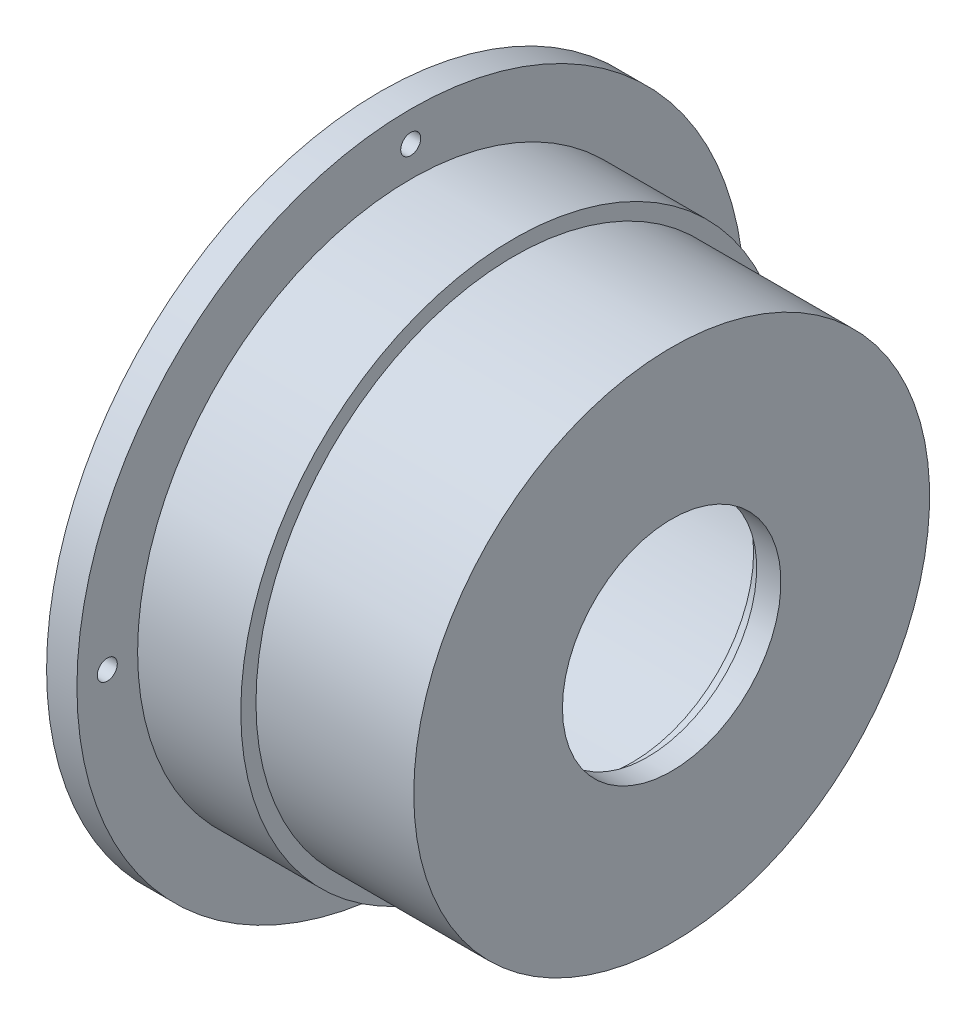
ISO-10303-21;
HEADER;
FILE_DESCRIPTION(('STEP AP214'),'2;1');
FILE_NAME('part.step','',(''),(''),'','','');
FILE_SCHEMA(('AUTOMOTIVE_DESIGN { 1 0 10303 214 1 1 1 1 }'));
ENDSEC;
DATA;
#1=APPLICATION_CONTEXT('core data for automotive mechanical design processes');
#2=APPLICATION_PROTOCOL_DEFINITION('international standard','automotive_design',2000,#1);
#3=PRODUCT_CONTEXT('',#1,'mechanical');
#4=PRODUCT('Part','Part','',(#3));
#5=PRODUCT_RELATED_PRODUCT_CATEGORY('part','',(#4));
#6=PRODUCT_DEFINITION_FORMATION('','',#4);
#7=PRODUCT_DEFINITION_CONTEXT('part definition',#1,'design');
#8=PRODUCT_DEFINITION('design','',#6,#7);
#9=PRODUCT_DEFINITION_SHAPE('','',#8);
#10=(LENGTH_UNIT() NAMED_UNIT(*) SI_UNIT(.MILLI.,.METRE.));
#11=(NAMED_UNIT(*) PLANE_ANGLE_UNIT() SI_UNIT($,.RADIAN.));
#12=(NAMED_UNIT(*) SI_UNIT($,.STERADIAN.) SOLID_ANGLE_UNIT());
#13=UNCERTAINTY_MEASURE_WITH_UNIT(LENGTH_MEASURE(1.E-05),#10,'distance_accuracy_value','');
#14=(GEOMETRIC_REPRESENTATION_CONTEXT(3) GLOBAL_UNCERTAINTY_ASSIGNED_CONTEXT((#13)) GLOBAL_UNIT_ASSIGNED_CONTEXT((#10,
#11,#12)) REPRESENTATION_CONTEXT('',''));
#15=CARTESIAN_POINT('',(0.,0.,0.));
#16=DIRECTION('',(0.,0.,1.));
#17=DIRECTION('',(1.,0.,0.));
#18=AXIS2_PLACEMENT_3D('',#15,#16,#17);
#19=CARTESIAN_POINT('',(0.,55.,0.));
#20=DIRECTION('',(1.,0.,0.));
#21=DIRECTION('',(0.,0.,-1.));
#22=AXIS2_PLACEMENT_3D('',#19,#20,#21);
#23=PLANE('',#22);
#24=CARTESIAN_POINT('',(0.,50.,0.));
#25=DIRECTION('',(-1.,0.,0.));
#26=DIRECTION('',(0.,0.,1.));
#27=AXIS2_PLACEMENT_3D('',#24,#25,#26);
#28=CIRCLE('',#27,1.64999999999999);
#29=CARTESIAN_POINT('',(0.,50.,1.64999999999999));
#30=VERTEX_POINT('',#29);
#31=EDGE_CURVE('E77',#30,#30,#28,.T.);
#32=ORIENTED_EDGE('',*,*,#31,.F.);
#33=EDGE_LOOP('',(#32));
#34=FACE_BOUND('',#33,.T.);
#35=CARTESIAN_POINT('',(0.,0.,50.));
#36=DIRECTION('',(-1.,0.,0.));
#37=DIRECTION('',(0.,0.,1.));
#38=AXIS2_PLACEMENT_3D('',#35,#36,#37);
#39=CIRCLE('',#38,1.64999999999999);
#40=CARTESIAN_POINT('',(0.,0.,51.65));
#41=VERTEX_POINT('',#40);
#42=EDGE_CURVE('E64',#41,#41,#39,.T.);
#43=ORIENTED_EDGE('',*,*,#42,.F.);
#44=EDGE_LOOP('',(#43));
#45=FACE_BOUND('',#44,.T.);
#46=CARTESIAN_POINT('',(0.,-50.,0.));
#47=DIRECTION('',(-1.,0.,0.));
#48=DIRECTION('',(0.,0.,1.));
#49=AXIS2_PLACEMENT_3D('',#46,#47,#48);
#50=CIRCLE('',#49,1.64999999999999);
#51=CARTESIAN_POINT('',(0.,-50.,1.64999999999999));
#52=VERTEX_POINT('',#51);
#53=EDGE_CURVE('E60',#52,#52,#50,.T.);
#54=ORIENTED_EDGE('',*,*,#53,.F.);
#55=EDGE_LOOP('',(#54));
#56=FACE_BOUND('',#55,.T.);
#57=CARTESIAN_POINT('',(0.,0.,0.));
#58=DIRECTION('',(-1.,0.,0.));
#59=DIRECTION('',(0.,0.,1.));
#60=AXIS2_PLACEMENT_3D('',#57,#58,#59);
#61=CIRCLE('',#60,37.6);
#62=CARTESIAN_POINT('',(0.,0.,37.6));
#63=VERTEX_POINT('',#62);
#64=EDGE_CURVE('E10',#63,#63,#61,.T.);
#65=ORIENTED_EDGE('',*,*,#64,.F.);
#66=EDGE_LOOP('',(#65));
#67=FACE_BOUND('',#66,.T.);
#68=CARTESIAN_POINT('',(0.,0.,0.));
#69=DIRECTION('',(-1.,0.,0.));
#70=DIRECTION('',(0.,0.,1.));
#71=AXIS2_PLACEMENT_3D('',#68,#69,#70);
#72=CIRCLE('',#71,55.);
#73=CARTESIAN_POINT('',(0.,0.,55.));
#74=VERTEX_POINT('',#73);
#75=EDGE_CURVE('E87',#74,#74,#72,.T.);
#76=ORIENTED_EDGE('',*,*,#75,.T.);
#77=EDGE_LOOP('',(#76));
#78=FACE_BOUND('',#77,.T.);
#79=CARTESIAN_POINT('',(0.,0.,-50.));
#80=DIRECTION('',(-1.,0.,0.));
#81=DIRECTION('',(0.,0.,1.));
#82=AXIS2_PLACEMENT_3D('',#79,#80,#81);
#83=CIRCLE('',#82,1.64999999999999);
#84=CARTESIAN_POINT('',(0.,0.,-48.35));
#85=VERTEX_POINT('',#84);
#86=EDGE_CURVE('E59',#85,#85,#83,.T.);
#87=ORIENTED_EDGE('',*,*,#86,.F.);
#88=EDGE_LOOP('',(#87));
#89=FACE_BOUND('',#88,.T.);
#90=ADVANCED_FACE('F37',(#34,#45,#56,#67,#78,#89),#23,.F.);
#91=CARTESIAN_POINT('',(-64.1033524540557,0.,0.));
#92=DIRECTION('',(-1.,0.,0.));
#93=DIRECTION('',(0.,0.,1.));
#94=AXIS2_PLACEMENT_3D('',#91,#92,#93);
#95=CYLINDRICAL_SURFACE('',#94,37.6);
#96=CARTESIAN_POINT('',(41.5,0.,0.));
#97=DIRECTION('',(-1.,0.,0.));
#98=DIRECTION('',(0.,0.,1.));
#99=AXIS2_PLACEMENT_3D('',#96,#97,#98);
#100=CIRCLE('',#99,37.6);
#101=CARTESIAN_POINT('',(41.5,0.,37.6));
#102=VERTEX_POINT('',#101);
#103=EDGE_CURVE('E46',#102,#102,#100,.T.);
#104=ORIENTED_EDGE('',*,*,#103,.F.);
#105=EDGE_LOOP('',(#104));
#106=FACE_BOUND('',#105,.T.);
#107=ORIENTED_EDGE('',*,*,#64,.T.);
#108=EDGE_LOOP('',(#107));
#109=FACE_BOUND('',#108,.T.);
#110=ADVANCED_FACE('F39',(#106,#109),#95,.F.);
#111=CARTESIAN_POINT('',(41.5,37.6,0.));
#112=DIRECTION('',(1.,0.,0.));
#113=DIRECTION('',(0.,0.,-1.));
#114=AXIS2_PLACEMENT_3D('',#111,#112,#113);
#115=PLANE('',#114);
#116=CARTESIAN_POINT('',(41.5000000000001,0.,0.));
#117=DIRECTION('',(-1.,0.,0.));
#118=DIRECTION('',(0.,0.,1.));
#119=AXIS2_PLACEMENT_3D('',#116,#117,#118);
#120=CIRCLE('',#119,20.);
#121=CARTESIAN_POINT('',(41.5000000000001,0.,20.));
#122=VERTEX_POINT('',#121);
#123=EDGE_CURVE('E52',#122,#122,#120,.T.);
#124=ORIENTED_EDGE('',*,*,#123,.F.);
#125=EDGE_LOOP('',(#124));
#126=FACE_BOUND('',#125,.T.);
#127=ORIENTED_EDGE('',*,*,#103,.T.);
#128=EDGE_LOOP('',(#127));
#129=FACE_BOUND('',#128,.T.);
#130=ADVANCED_FACE('F128',(#126,#129),#115,.F.);
#131=CARTESIAN_POINT('',(-64.1033524540557,0.,0.));
#132=DIRECTION('',(-1.,0.,0.));
#133=DIRECTION('',(0.,0.,1.));
#134=AXIS2_PLACEMENT_3D('',#131,#132,#133);
#135=CYLINDRICAL_SURFACE('',#134,20.);
#136=CARTESIAN_POINT('',(44.,0.,0.));
#137=DIRECTION('',(-1.,0.,0.));
#138=DIRECTION('',(0.,0.,1.));
#139=AXIS2_PLACEMENT_3D('',#136,#137,#138);
#140=CIRCLE('',#139,20.);
#141=CARTESIAN_POINT('',(44.,0.,20.));
#142=VERTEX_POINT('',#141);
#143=EDGE_CURVE('E119',#142,#142,#140,.T.);
#144=ORIENTED_EDGE('',*,*,#143,.F.);
#145=EDGE_LOOP('',(#144));
#146=FACE_BOUND('',#145,.T.);
#147=ORIENTED_EDGE('',*,*,#123,.T.);
#148=EDGE_LOOP('',(#147));
#149=FACE_BOUND('',#148,.T.);
#150=ADVANCED_FACE('F126',(#146,#149),#135,.F.);
#151=CARTESIAN_POINT('',(44.0000000000001,20.,0.));
#152=DIRECTION('',(1.,0.,0.));
#153=DIRECTION('',(0.,0.,-1.));
#154=AXIS2_PLACEMENT_3D('',#151,#152,#153);
#155=PLANE('',#154);
#156=CARTESIAN_POINT('',(44.0000000000001,0.,0.));
#157=DIRECTION('',(-1.,0.,0.));
#158=DIRECTION('',(0.,0.,1.));
#159=AXIS2_PLACEMENT_3D('',#156,#157,#158);
#160=CIRCLE('',#159,18.);
#161=CARTESIAN_POINT('',(44.0000000000001,0.,18.));
#162=VERTEX_POINT('',#161);
#163=EDGE_CURVE('E115',#162,#162,#160,.T.);
#164=ORIENTED_EDGE('',*,*,#163,.F.);
#165=EDGE_LOOP('',(#164));
#166=FACE_BOUND('',#165,.T.);
#167=ORIENTED_EDGE('',*,*,#143,.T.);
#168=EDGE_LOOP('',(#167));
#169=FACE_BOUND('',#168,.T.);
#170=ADVANCED_FACE('F174',(#166,#169),#155,.F.);
#171=CARTESIAN_POINT('',(-64.1033524540557,0.,0.));
#172=DIRECTION('',(-1.,0.,0.));
#173=DIRECTION('',(0.,0.,1.));
#174=AXIS2_PLACEMENT_3D('',#171,#172,#173);
#175=CYLINDRICAL_SURFACE('',#174,18.);
#176=CARTESIAN_POINT('',(48.0000000000001,0.,0.));
#177=DIRECTION('',(-1.,0.,0.));
#178=DIRECTION('',(0.,0.,1.));
#179=AXIS2_PLACEMENT_3D('',#176,#177,#178);
#180=CIRCLE('',#179,18.);
#181=CARTESIAN_POINT('',(48.0000000000001,0.,18.));
#182=VERTEX_POINT('',#181);
#183=EDGE_CURVE('E111',#182,#182,#180,.T.);
#184=ORIENTED_EDGE('',*,*,#183,.F.);
#185=EDGE_LOOP('',(#184));
#186=FACE_BOUND('',#185,.T.);
#187=ORIENTED_EDGE('',*,*,#163,.T.);
#188=EDGE_LOOP('',(#187));
#189=FACE_BOUND('',#188,.T.);
#190=ADVANCED_FACE('F170',(#186,#189),#175,.F.);
#191=CARTESIAN_POINT('',(48.0000000000001,18.,0.));
#192=DIRECTION('',(-1.,0.,0.));
#193=DIRECTION('',(0.,0.,1.));
#194=AXIS2_PLACEMENT_3D('',#191,#192,#193);
#195=PLANE('',#194);
#196=CARTESIAN_POINT('',(48.0000000000001,0.,0.));
#197=DIRECTION('',(-1.,0.,0.));
#198=DIRECTION('',(0.,0.,1.));
#199=AXIS2_PLACEMENT_3D('',#196,#197,#198);
#200=CIRCLE('',#199,42.5);
#201=CARTESIAN_POINT('',(48.0000000000001,0.,42.5));
#202=VERTEX_POINT('',#201);
#203=EDGE_CURVE('E107',#202,#202,#200,.T.);
#204=ORIENTED_EDGE('',*,*,#203,.F.);
#205=EDGE_LOOP('',(#204));
#206=FACE_BOUND('',#205,.T.);
#207=ORIENTED_EDGE('',*,*,#183,.T.);
#208=EDGE_LOOP('',(#207));
#209=FACE_BOUND('',#208,.T.);
#210=ADVANCED_FACE('F166',(#206,#209),#195,.F.);
#211=CARTESIAN_POINT('',(-64.1033524540557,0.,0.));
#212=DIRECTION('',(-1.,0.,0.));
#213=DIRECTION('',(0.,0.,1.));
#214=AXIS2_PLACEMENT_3D('',#211,#212,#213);
#215=CYLINDRICAL_SURFACE('',#214,42.5);
#216=CARTESIAN_POINT('',(22.,0.,0.));
#217=DIRECTION('',(-1.,0.,0.));
#218=DIRECTION('',(0.,0.,1.));
#219=AXIS2_PLACEMENT_3D('',#216,#217,#218);
#220=CIRCLE('',#219,42.5);
#221=CARTESIAN_POINT('',(22.,0.,42.5));
#222=VERTEX_POINT('',#221);
#223=EDGE_CURVE('E103',#222,#222,#220,.T.);
#224=ORIENTED_EDGE('',*,*,#223,.F.);
#225=EDGE_LOOP('',(#224));
#226=FACE_BOUND('',#225,.T.);
#227=ORIENTED_EDGE('',*,*,#203,.T.);
#228=EDGE_LOOP('',(#227));
#229=FACE_BOUND('',#228,.T.);
#230=ADVANCED_FACE('F162',(#226,#229),#215,.T.);
#231=CARTESIAN_POINT('',(22.,42.5,0.));
#232=DIRECTION('',(-1.,0.,0.));
#233=DIRECTION('',(0.,0.,1.));
#234=AXIS2_PLACEMENT_3D('',#231,#232,#233);
#235=PLANE('',#234);
#236=CARTESIAN_POINT('',(22.,0.,0.));
#237=DIRECTION('',(-1.,0.,0.));
#238=DIRECTION('',(0.,0.,1.));
#239=AXIS2_PLACEMENT_3D('',#236,#237,#238);
#240=CIRCLE('',#239,45.);
#241=CARTESIAN_POINT('',(22.,0.,45.));
#242=VERTEX_POINT('',#241);
#243=EDGE_CURVE('E99',#242,#242,#240,.T.);
#244=ORIENTED_EDGE('',*,*,#243,.F.);
#245=EDGE_LOOP('',(#244));
#246=FACE_BOUND('',#245,.T.);
#247=ORIENTED_EDGE('',*,*,#223,.T.);
#248=EDGE_LOOP('',(#247));
#249=FACE_BOUND('',#248,.T.);
#250=ADVANCED_FACE('F158',(#246,#249),#235,.F.);
#251=CARTESIAN_POINT('',(-64.1033524540557,0.,0.));
#252=DIRECTION('',(-1.,0.,0.));
#253=DIRECTION('',(0.,0.,1.));
#254=AXIS2_PLACEMENT_3D('',#251,#252,#253);
#255=CYLINDRICAL_SURFACE('',#254,45.);
#256=CARTESIAN_POINT('',(5.,0.,0.));
#257=DIRECTION('',(-1.,0.,0.));
#258=DIRECTION('',(0.,0.,1.));
#259=AXIS2_PLACEMENT_3D('',#256,#257,#258);
#260=CIRCLE('',#259,45.);
#261=CARTESIAN_POINT('',(5.,0.,45.));
#262=VERTEX_POINT('',#261);
#263=EDGE_CURVE('E95',#262,#262,#260,.T.);
#264=ORIENTED_EDGE('',*,*,#263,.F.);
#265=EDGE_LOOP('',(#264));
#266=FACE_BOUND('',#265,.T.);
#267=ORIENTED_EDGE('',*,*,#243,.T.);
#268=EDGE_LOOP('',(#267));
#269=FACE_BOUND('',#268,.T.);
#270=ADVANCED_FACE('F154',(#266,#269),#255,.T.);
#271=CARTESIAN_POINT('',(5.,45.,0.));
#272=DIRECTION('',(-1.,0.,0.));
#273=DIRECTION('',(0.,0.,1.));
#274=AXIS2_PLACEMENT_3D('',#271,#272,#273);
#275=PLANE('',#274);
#276=CARTESIAN_POINT('',(5.,50.,0.));
#277=DIRECTION('',(-1.,0.,0.));
#278=DIRECTION('',(0.,0.,1.));
#279=AXIS2_PLACEMENT_3D('',#276,#277,#278);
#280=CIRCLE('',#279,1.64999999999999);
#281=CARTESIAN_POINT('',(5.,50.,1.64999999999999));
#282=VERTEX_POINT('',#281);
#283=EDGE_CURVE('E41',#282,#282,#280,.T.);
#284=ORIENTED_EDGE('',*,*,#283,.T.);
#285=EDGE_LOOP('',(#284));
#286=FACE_BOUND('',#285,.T.);
#287=CARTESIAN_POINT('',(5.,0.,50.));
#288=DIRECTION('',(-1.,0.,0.));
#289=DIRECTION('',(0.,0.,1.));
#290=AXIS2_PLACEMENT_3D('',#287,#288,#289);
#291=CIRCLE('',#290,1.64999999999999);
#292=CARTESIAN_POINT('',(5.,0.,51.65));
#293=VERTEX_POINT('',#292);
#294=EDGE_CURVE('E61',#293,#293,#291,.T.);
#295=ORIENTED_EDGE('',*,*,#294,.T.);
#296=EDGE_LOOP('',(#295));
#297=FACE_BOUND('',#296,.T.);
#298=CARTESIAN_POINT('',(5.,-50.,0.));
#299=DIRECTION('',(-1.,0.,0.));
#300=DIRECTION('',(0.,0.,1.));
#301=AXIS2_PLACEMENT_3D('',#298,#299,#300);
#302=CIRCLE('',#301,1.64999999999999);
#303=CARTESIAN_POINT('',(5.,-50.,1.64999999999999));
#304=VERTEX_POINT('',#303);
#305=EDGE_CURVE('E56',#304,#304,#302,.T.);
#306=ORIENTED_EDGE('',*,*,#305,.T.);
#307=EDGE_LOOP('',(#306));
#308=FACE_BOUND('',#307,.T.);
#309=CARTESIAN_POINT('',(5.,0.,-50.));
#310=DIRECTION('',(-1.,0.,0.));
#311=DIRECTION('',(0.,0.,1.));
#312=AXIS2_PLACEMENT_3D('',#309,#310,#311);
#313=CIRCLE('',#312,1.64999999999999);
#314=CARTESIAN_POINT('',(5.,0.,-48.35));
#315=VERTEX_POINT('',#314);
#316=EDGE_CURVE('E83',#315,#315,#313,.T.);
#317=ORIENTED_EDGE('',*,*,#316,.T.);
#318=EDGE_LOOP('',(#317));
#319=FACE_BOUND('',#318,.T.);
#320=CARTESIAN_POINT('',(5.,0.,0.));
#321=DIRECTION('',(-1.,0.,0.));
#322=DIRECTION('',(0.,0.,1.));
#323=AXIS2_PLACEMENT_3D('',#320,#321,#322);
#324=CIRCLE('',#323,55.);
#325=CARTESIAN_POINT('',(5.,0.,55.));
#326=VERTEX_POINT('',#325);
#327=EDGE_CURVE('E91',#326,#326,#324,.T.);
#328=ORIENTED_EDGE('',*,*,#327,.F.);
#329=EDGE_LOOP('',(#328));
#330=FACE_BOUND('',#329,.T.);
#331=ORIENTED_EDGE('',*,*,#263,.T.);
#332=EDGE_LOOP('',(#331));
#333=FACE_BOUND('',#332,.T.);
#334=ADVANCED_FACE('F150',(#286,#297,#308,#319,#330,#333),#275,.F.);
#335=CARTESIAN_POINT('',(-64.1033524540557,0.,0.));
#336=DIRECTION('',(-1.,0.,0.));
#337=DIRECTION('',(0.,0.,1.));
#338=AXIS2_PLACEMENT_3D('',#335,#336,#337);
#339=CYLINDRICAL_SURFACE('',#338,55.);
#340=ORIENTED_EDGE('',*,*,#75,.F.);
#341=EDGE_LOOP('',(#340));
#342=FACE_BOUND('',#341,.T.);
#343=ORIENTED_EDGE('',*,*,#327,.T.);
#344=EDGE_LOOP('',(#343));
#345=FACE_BOUND('',#344,.T.);
#346=ADVANCED_FACE('F147',(#342,#345),#339,.T.);
#347=CARTESIAN_POINT('',(0.,0.,-50.));
#348=DIRECTION('',(-1.,0.,0.));
#349=DIRECTION('',(0.,0.,1.));
#350=AXIS2_PLACEMENT_3D('',#347,#348,#349);
#351=CYLINDRICAL_SURFACE('',#350,1.64999999999999);
#352=ORIENTED_EDGE('',*,*,#86,.T.);
#353=EDGE_LOOP('',(#352));
#354=FACE_BOUND('',#353,.T.);
#355=ORIENTED_EDGE('',*,*,#316,.F.);
#356=EDGE_LOOP('',(#355));
#357=FACE_BOUND('',#356,.T.);
#358=ADVANCED_FACE('F145',(#354,#357),#351,.F.);
#359=CARTESIAN_POINT('',(0.,-50.,0.));
#360=DIRECTION('',(-1.,0.,0.));
#361=DIRECTION('',(0.,0.,1.));
#362=AXIS2_PLACEMENT_3D('',#359,#360,#361);
#363=CYLINDRICAL_SURFACE('',#362,1.64999999999999);
#364=ORIENTED_EDGE('',*,*,#53,.T.);
#365=EDGE_LOOP('',(#364));
#366=FACE_BOUND('',#365,.T.);
#367=ORIENTED_EDGE('',*,*,#305,.F.);
#368=EDGE_LOOP('',(#367));
#369=FACE_BOUND('',#368,.T.);
#370=ADVANCED_FACE('F225',(#366,#369),#363,.F.);
#371=CARTESIAN_POINT('',(0.,0.,50.));
#372=DIRECTION('',(-1.,0.,0.));
#373=DIRECTION('',(0.,0.,1.));
#374=AXIS2_PLACEMENT_3D('',#371,#372,#373);
#375=CYLINDRICAL_SURFACE('',#374,1.64999999999999);
#376=ORIENTED_EDGE('',*,*,#42,.T.);
#377=EDGE_LOOP('',(#376));
#378=FACE_BOUND('',#377,.T.);
#379=ORIENTED_EDGE('',*,*,#294,.F.);
#380=EDGE_LOOP('',(#379));
#381=FACE_BOUND('',#380,.T.);
#382=ADVANCED_FACE('F232',(#378,#381),#375,.F.);
#383=CARTESIAN_POINT('',(0.,50.,0.));
#384=DIRECTION('',(-1.,0.,0.));
#385=DIRECTION('',(0.,0.,1.));
#386=AXIS2_PLACEMENT_3D('',#383,#384,#385);
#387=CYLINDRICAL_SURFACE('',#386,1.64999999999999);
#388=ORIENTED_EDGE('',*,*,#31,.T.);
#389=EDGE_LOOP('',(#388));
#390=FACE_BOUND('',#389,.T.);
#391=ORIENTED_EDGE('',*,*,#283,.F.);
#392=EDGE_LOOP('',(#391));
#393=FACE_BOUND('',#392,.T.);
#394=ADVANCED_FACE('F239',(#390,#393),#387,.F.);
#395=CLOSED_SHELL('',(#90,#110,#130,#150,#170,#190,#210,#230,#250,#270,#334,#346,#358,#370,#382,#394));
#396=MANIFOLD_SOLID_BREP('B2',#395);
#397=ADVANCED_BREP_SHAPE_REPRESENTATION('',(#18,#396),#14);
#398=SHAPE_DEFINITION_REPRESENTATION(#9,#397);
ENDSEC;
END-ISO-10303-21;
